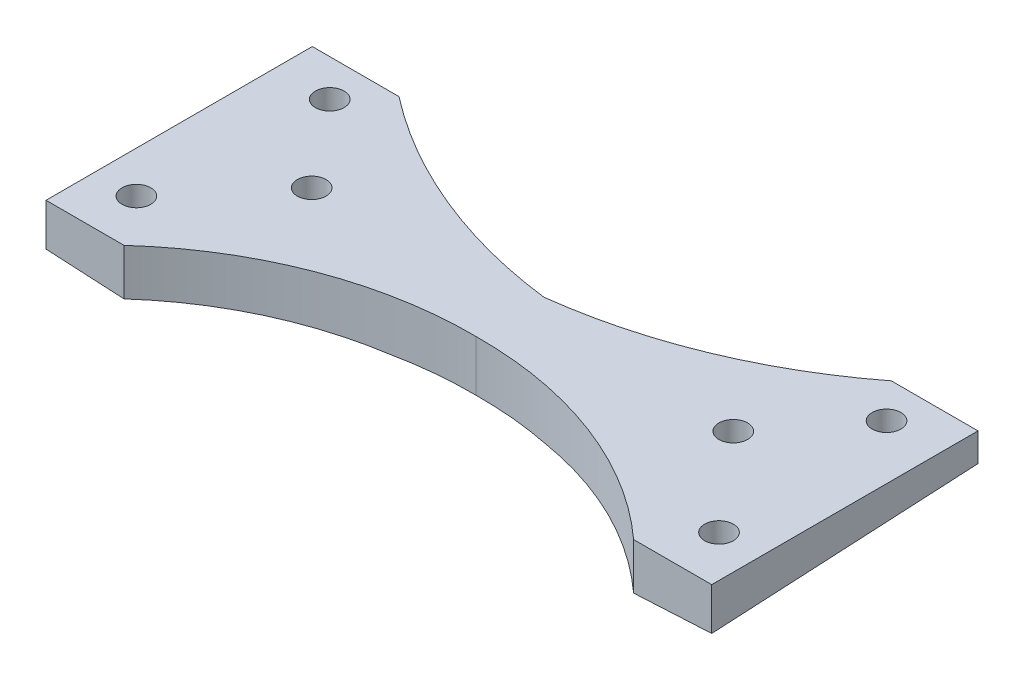
ISO-10303-21;
HEADER;
FILE_DESCRIPTION(('STEP AP214'),'2;1');
FILE_NAME('part.step','',(''),(''),'','','');
FILE_SCHEMA(('AUTOMOTIVE_DESIGN { 1 0 10303 214 1 1 1 1 }'));
ENDSEC;
DATA;
#1=APPLICATION_CONTEXT('core data for automotive mechanical design processes');
#2=APPLICATION_PROTOCOL_DEFINITION('international standard','automotive_design',2000,#1);
#3=PRODUCT_CONTEXT('',#1,'mechanical');
#4=PRODUCT('Part','Part','',(#3));
#5=PRODUCT_RELATED_PRODUCT_CATEGORY('part','',(#4));
#6=PRODUCT_DEFINITION_FORMATION('','',#4);
#7=PRODUCT_DEFINITION_CONTEXT('part definition',#1,'design');
#8=PRODUCT_DEFINITION('design','',#6,#7);
#9=PRODUCT_DEFINITION_SHAPE('','',#8);
#10=(LENGTH_UNIT() NAMED_UNIT(*) SI_UNIT(.MILLI.,.METRE.));
#11=(NAMED_UNIT(*) PLANE_ANGLE_UNIT() SI_UNIT($,.RADIAN.));
#12=(NAMED_UNIT(*) SI_UNIT($,.STERADIAN.) SOLID_ANGLE_UNIT());
#13=UNCERTAINTY_MEASURE_WITH_UNIT(LENGTH_MEASURE(1.E-05),#10,'distance_accuracy_value','');
#14=(GEOMETRIC_REPRESENTATION_CONTEXT(3) GLOBAL_UNCERTAINTY_ASSIGNED_CONTEXT((#13)) GLOBAL_UNIT_ASSIGNED_CONTEXT((#10,
#11,#12)) REPRESENTATION_CONTEXT('',''));
#15=CARTESIAN_POINT('',(0.,0.,0.));
#16=DIRECTION('',(0.,0.,1.));
#17=DIRECTION('',(1.,0.,0.));
#18=AXIS2_PLACEMENT_3D('',#15,#16,#17);
#19=CARTESIAN_POINT('',(0.,43.8649334271713,-12.7));
#20=DIRECTION('',(0.,1.,0.));
#21=DIRECTION('',(-1.,0.,0.));
#22=AXIS2_PLACEMENT_3D('',#19,#20,#21);
#23=PLANE('',#22);
#24=CARTESIAN_POINT('',(-0.330657519158692,43.8649334271713,39.0967859037488));
#25=DIRECTION('',(0.,1.,0.));
#26=DIRECTION('',(-1.,0.,0.));
#27=AXIS2_PLACEMENT_3D('',#24,#25,#26);
#28=CIRCLE('',#27,35.656708656681);
#29=CARTESIAN_POINT('',(0.,43.8649334271713,3.44161043324442));
#30=VERTEX_POINT('',#29);
#31=CARTESIAN_POINT('',(-7.49527492738726,43.8649334271713,4.16729793697291));
#32=VERTEX_POINT('',#31);
#33=EDGE_CURVE('E212',#30,#32,#28,.T.);
#34=ORIENTED_EDGE('',*,*,#33,.T.);
#35=DIRECTION('',(0.707591479715552,0.,-0.706621750184606));
#36=VECTOR('',#35,1.);
#37=CARTESIAN_POINT('',(4.69114310024992,43.8649334271713,-8.00241902829053));
#38=LINE('',#37,#36);
#39=CARTESIAN_POINT('',(-0.245723812969967,43.8649334271713,-3.07231791959667));
#40=VERTEX_POINT('',#39);
#41=EDGE_CURVE('E190',#32,#40,#38,.T.);
#42=ORIENTED_EDGE('',*,*,#41,.T.);
#43=CARTESIAN_POINT('',(5.82833310932793,43.8649334271713,-50.5915810702663));
#44=DIRECTION('',(0.,1.,0.));
#45=DIRECTION('',(-1.,0.,0.));
#46=AXIS2_PLACEMENT_3D('',#43,#44,#45);
#47=CIRCLE('',#46,47.9058925172875);
#48=CARTESIAN_POINT('',(0.,43.8649334271713,-3.04155403510453));
#49=VERTEX_POINT('',#48);
#50=EDGE_CURVE('E146',#40,#49,#47,.T.);
#51=ORIENTED_EDGE('',*,*,#50,.T.);
#52=CARTESIAN_POINT('',(-5.82833310932795,43.8649334271713,-50.5915810702663));
#53=DIRECTION('',(0.,-1.,0.));
#54=DIRECTION('',(1.,0.,0.));
#55=AXIS2_PLACEMENT_3D('',#52,#53,#54);
#56=CIRCLE('',#55,47.9058925172875);
#57=CARTESIAN_POINT('',(0.245723812969947,43.8649334271713,-3.07231791959667));
#58=VERTEX_POINT('',#57);
#59=EDGE_CURVE('E126',#58,#49,#56,.T.);
#60=ORIENTED_EDGE('',*,*,#59,.F.);
#61=DIRECTION('',(-0.707591479715552,0.,-0.706621750184606));
#62=VECTOR('',#61,1.);
#63=CARTESIAN_POINT('',(-4.69114310024994,43.8649334271713,-8.00241902829053));
#64=LINE('',#63,#62);
#65=CARTESIAN_POINT('',(7.49527492738723,43.8649334271713,4.16729793697291));
#66=VERTEX_POINT('',#65);
#67=EDGE_CURVE('E134',#66,#58,#64,.T.);
#68=ORIENTED_EDGE('',*,*,#67,.F.);
#69=CARTESIAN_POINT('',(0.330657519158671,43.8649334271713,39.0967859037488));
#70=DIRECTION('',(0.,-1.,0.));
#71=DIRECTION('',(1.,0.,0.));
#72=AXIS2_PLACEMENT_3D('',#69,#70,#71);
#73=CIRCLE('',#72,35.656708656681);
#74=EDGE_CURVE('E160',#30,#66,#73,.T.);
#75=ORIENTED_EDGE('',*,*,#74,.F.);
#76=EDGE_LOOP('',(#34,#42,#51,#60,#68,#75));
#77=FACE_BOUND('',#76,.T.);
#78=ADVANCED_FACE('F34',(#77),#23,.F.);
#79=CARTESIAN_POINT('',(-31.75,48.7240290397441,-12.7));
#80=DIRECTION('',(-1.,0.,0.));
#81=DIRECTION('',(0.,0.,1.));
#82=AXIS2_PLACEMENT_3D('',#79,#80,#81);
#83=PLANE('',#82);
#84=DIRECTION('',(0.,0.0524075821519379,-0.998625778424024));
#85=VECTOR('',#84,1.);
#86=CARTESIAN_POINT('',(-31.75,46.0286837575568,-12.8414509142023));
#87=LINE('',#86,#85);
#88=CARTESIAN_POINT('',(-31.75,44.6882760533032,12.7));
#89=VERTEX_POINT('',#88);
#90=CARTESIAN_POINT('',(-31.75,46.0212604558889,-12.7));
#91=VERTEX_POINT('',#90);
#92=EDGE_CURVE('E188',#89,#91,#87,.T.);
#93=ORIENTED_EDGE('',*,*,#92,.F.);
#94=DIRECTION('',(0.,-1.,0.));
#95=VECTOR('',#94,1.);
#96=CARTESIAN_POINT('',(-31.75,48.7240290397441,12.7));
#97=LINE('',#96,#95);
#98=CARTESIAN_POINT('',(-31.75,48.7240290397441,12.7));
#99=VERTEX_POINT('',#98);
#100=EDGE_CURVE('E223',#99,#89,#97,.T.);
#101=ORIENTED_EDGE('',*,*,#100,.F.);
#102=DIRECTION('',(0.,0.,1.));
#103=VECTOR('',#102,1.);
#104=CARTESIAN_POINT('',(-31.75,48.7240290397441,-12.7));
#105=LINE('',#104,#103);
#106=CARTESIAN_POINT('',(-31.75,48.7240290397441,-12.7));
#107=VERTEX_POINT('',#106);
#108=EDGE_CURVE('E233',#107,#99,#105,.T.);
#109=ORIENTED_EDGE('',*,*,#108,.F.);
#110=DIRECTION('',(0.,-1.,0.));
#111=VECTOR('',#110,1.);
#112=CARTESIAN_POINT('',(-31.75,48.7240290397441,-12.7));
#113=LINE('',#112,#111);
#114=EDGE_CURVE('E228',#107,#91,#113,.T.);
#115=ORIENTED_EDGE('',*,*,#114,.T.);
#116=EDGE_LOOP('',(#93,#101,#109,#115));
#117=FACE_BOUND('',#116,.T.);
#118=ADVANCED_FACE('F251',(#117),#83,.T.);
#119=CARTESIAN_POINT('',(0.,48.7240290397441,-12.7));
#120=DIRECTION('',(0.,1.,0.));
#121=DIRECTION('',(-1.,0.,0.));
#122=AXIS2_PLACEMENT_3D('',#119,#120,#121);
#123=PLANE('',#122);
#124=CARTESIAN_POINT('',(5.82833310932792,48.7240290397441,-50.5915810702663));
#125=DIRECTION('',(0.,1.,0.));
#126=DIRECTION('',(1.,0.,0.));
#127=AXIS2_PLACEMENT_3D('',#124,#125,#126);
#128=CIRCLE('',#127,47.9058925172875);
#129=CARTESIAN_POINT('',(-23.4838251509118,48.7240290397441,-12.7));
#130=VERTEX_POINT('',#129);
#131=CARTESIAN_POINT('',(0.,48.7240290397441,-3.04155403510453));
#132=VERTEX_POINT('',#131);
#133=EDGE_CURVE('E206',#130,#132,#128,.T.);
#134=ORIENTED_EDGE('',*,*,#133,.F.);
#135=DIRECTION('',(-1.,0.,0.));
#136=VECTOR('',#135,1.);
#137=CARTESIAN_POINT('',(0.,48.7240290397441,-12.7));
#138=LINE('',#137,#136);
#139=EDGE_CURVE('E231',#130,#107,#138,.T.);
#140=ORIENTED_EDGE('',*,*,#139,.T.);
#141=ORIENTED_EDGE('',*,*,#108,.T.);
#142=DIRECTION('',(-1.,0.,0.));
#143=VECTOR('',#142,1.);
#144=CARTESIAN_POINT('',(0.,48.7240290397441,12.7));
#145=LINE('',#144,#143);
#146=CARTESIAN_POINT('',(-24.3016935038441,48.7240290397441,12.7));
#147=VERTEX_POINT('',#146);
#148=EDGE_CURVE('E226',#147,#99,#145,.T.);
#149=ORIENTED_EDGE('',*,*,#148,.F.);
#150=CARTESIAN_POINT('',(-0.330657519158696,48.7240290397441,39.0967859037488));
#151=DIRECTION('',(0.,1.,0.));
#152=DIRECTION('',(-1.,0.,0.));
#153=AXIS2_PLACEMENT_3D('',#150,#151,#152);
#154=CIRCLE('',#153,35.656708656681);
#155=CARTESIAN_POINT('',(0.,48.7240290397441,3.44161043324442));
#156=VERTEX_POINT('',#155);
#157=EDGE_CURVE('E210',#156,#147,#154,.T.);
#158=ORIENTED_EDGE('',*,*,#157,.F.);
#159=CARTESIAN_POINT('',(0.330657519158673,48.7240290397441,39.0967859037488));
#160=DIRECTION('',(0.,-1.,0.));
#161=DIRECTION('',(1.,0.,0.));
#162=AXIS2_PLACEMENT_3D('',#159,#160,#161);
#163=CIRCLE('',#162,35.656708656681);
#164=CARTESIAN_POINT('',(24.3016935038441,48.7240290397441,12.7));
#165=VERTEX_POINT('',#164);
#166=EDGE_CURVE('E148',#156,#165,#163,.T.);
#167=ORIENTED_EDGE('',*,*,#166,.T.);
#168=DIRECTION('',(1.,0.,0.));
#169=VECTOR('',#168,1.);
#170=CARTESIAN_POINT('',(0.,48.7240290397441,12.7));
#171=LINE('',#170,#169);
#172=CARTESIAN_POINT('',(31.75,48.7240290397441,12.7));
#173=VERTEX_POINT('',#172);
#174=EDGE_CURVE('E174',#165,#173,#171,.T.);
#175=ORIENTED_EDGE('',*,*,#174,.T.);
#176=DIRECTION('',(0.,0.,1.));
#177=VECTOR('',#176,1.);
#178=CARTESIAN_POINT('',(31.75,48.7240290397441,-12.7));
#179=LINE('',#178,#177);
#180=CARTESIAN_POINT('',(31.75,48.7240290397441,-12.7));
#181=VERTEX_POINT('',#180);
#182=EDGE_CURVE('E181',#181,#173,#179,.T.);
#183=ORIENTED_EDGE('',*,*,#182,.F.);
#184=DIRECTION('',(1.,0.,0.));
#185=VECTOR('',#184,1.);
#186=CARTESIAN_POINT('',(0.,48.7240290397441,-12.7));
#187=LINE('',#186,#185);
#188=CARTESIAN_POINT('',(23.4838251509118,48.7240290397441,-12.7));
#189=VERTEX_POINT('',#188);
#190=EDGE_CURVE('E179',#189,#181,#187,.T.);
#191=ORIENTED_EDGE('',*,*,#190,.F.);
#192=CARTESIAN_POINT('',(-5.82833310932794,48.7240290397441,-50.5915810702663));
#193=DIRECTION('',(0.,-1.,0.));
#194=DIRECTION('',(-1.,0.,0.));
#195=AXIS2_PLACEMENT_3D('',#192,#193,#194);
#196=CIRCLE('',#195,47.9058925172875);
#197=EDGE_CURVE('E154',#189,#132,#196,.T.);
#198=ORIENTED_EDGE('',*,*,#197,.T.);
#199=EDGE_LOOP('',(#134,#140,#141,#149,#158,#167,#175,#183,#191,#198));
#200=FACE_BOUND('',#199,.T.);
#201=CARTESIAN_POINT('',(-27.7864763711904,48.7240290397441,8.04056841193557));
#202=DIRECTION('',(0.,1.,0.));
#203=DIRECTION('',(-1.,0.,0.));
#204=AXIS2_PLACEMENT_3D('',#201,#202,#203);
#205=CIRCLE('',#204,1.3716);
#206=CARTESIAN_POINT('',(-29.1580763711904,48.7240290397441,8.04056841193557));
#207=VERTEX_POINT('',#206);
#208=EDGE_CURVE('E214',#207,#207,#205,.T.);
#209=ORIENTED_EDGE('',*,*,#208,.F.);
#210=EDGE_LOOP('',(#209));
#211=FACE_BOUND('',#210,.T.);
#212=CARTESIAN_POINT('',(-26.555704526281,48.7240290397441,-9.16997169185407));
#213=DIRECTION('',(0.,1.,0.));
#214=DIRECTION('',(-1.,0.,0.));
#215=AXIS2_PLACEMENT_3D('',#212,#213,#214);
#216=CIRCLE('',#215,1.3716);
#217=CARTESIAN_POINT('',(-27.927304526281,48.7240290397441,-9.16997169185407));
#218=VERTEX_POINT('',#217);
#219=EDGE_CURVE('E217',#218,#218,#216,.T.);
#220=ORIENTED_EDGE('',*,*,#219,.F.);
#221=EDGE_LOOP('',(#220));
#222=FACE_BOUND('',#221,.T.);
#223=CARTESIAN_POINT('',(-20.1056477234083,48.7240290397441,-0.999384842334194));
#224=DIRECTION('',(0.,1.,0.));
#225=DIRECTION('',(-1.,0.,0.));
#226=AXIS2_PLACEMENT_3D('',#223,#224,#225);
#227=CIRCLE('',#226,1.3716);
#228=CARTESIAN_POINT('',(-21.4772477234083,48.7240290397441,-0.999384842334194));
#229=VERTEX_POINT('',#228);
#230=EDGE_CURVE('E220',#229,#229,#227,.T.);
#231=ORIENTED_EDGE('',*,*,#230,.F.);
#232=EDGE_LOOP('',(#231));
#233=FACE_BOUND('',#232,.T.);
#234=CARTESIAN_POINT('',(27.7864763711904,48.7240290397441,8.04056841193557));
#235=DIRECTION('',(0.,-1.,0.));
#236=DIRECTION('',(1.,0.,0.));
#237=AXIS2_PLACEMENT_3D('',#234,#235,#236);
#238=CIRCLE('',#237,1.3716);
#239=CARTESIAN_POINT('',(29.1580763711904,48.7240290397441,8.04056841193557));
#240=VERTEX_POINT('',#239);
#241=EDGE_CURVE('E162',#240,#240,#238,.T.);
#242=ORIENTED_EDGE('',*,*,#241,.T.);
#243=EDGE_LOOP('',(#242));
#244=FACE_BOUND('',#243,.T.);
#245=CARTESIAN_POINT('',(26.555704526281,48.7240290397441,-9.16997169185407));
#246=DIRECTION('',(0.,-1.,0.));
#247=DIRECTION('',(1.,0.,0.));
#248=AXIS2_PLACEMENT_3D('',#245,#246,#247);
#249=CIRCLE('',#248,1.3716);
#250=CARTESIAN_POINT('',(27.927304526281,48.7240290397441,-9.16997169185407));
#251=VERTEX_POINT('',#250);
#252=EDGE_CURVE('E165',#251,#251,#249,.T.);
#253=ORIENTED_EDGE('',*,*,#252,.T.);
#254=EDGE_LOOP('',(#253));
#255=FACE_BOUND('',#254,.T.);
#256=CARTESIAN_POINT('',(20.1056477234083,48.7240290397441,-0.999384842334194));
#257=DIRECTION('',(0.,-1.,0.));
#258=DIRECTION('',(1.,0.,0.));
#259=AXIS2_PLACEMENT_3D('',#256,#257,#258);
#260=CIRCLE('',#259,1.3716);
#261=CARTESIAN_POINT('',(21.4772477234083,48.7240290397441,-0.999384842334194));
#262=VERTEX_POINT('',#261);
#263=EDGE_CURVE('E168',#262,#262,#260,.T.);
#264=ORIENTED_EDGE('',*,*,#263,.T.);
#265=EDGE_LOOP('',(#264));
#266=FACE_BOUND('',#265,.T.);
#267=ADVANCED_FACE('F243',(#200,#211,#222,#233,#244,#255,#266),#123,.T.);
#268=CARTESIAN_POINT('',(0.,0.,-12.7));
#269=DIRECTION('',(0.,0.,-1.));
#270=DIRECTION('',(-1.,0.,0.));
#271=AXIS2_PLACEMENT_3D('',#268,#269,#270);
#272=PLANE('',#271);
#273=DIRECTION('',(0.998629534754574,-0.0523359562429411,0.));
#274=VECTOR('',#273,1.);
#275=CARTESIAN_POINT('',(2.31830090551847,44.2358164614844,-12.7));
#276=LINE('',#275,#274);
#277=CARTESIAN_POINT('',(-23.4838251509118,45.5880485888829,-12.7));
#278=VERTEX_POINT('',#277);
#279=EDGE_CURVE('E48',#91,#278,#276,.T.);
#280=ORIENTED_EDGE('',*,*,#279,.F.);
#281=ORIENTED_EDGE('',*,*,#114,.F.);
#282=ORIENTED_EDGE('',*,*,#139,.F.);
#283=DIRECTION('',(0.,1.,0.));
#284=VECTOR('',#283,1.);
#285=CARTESIAN_POINT('',(-23.4838251509118,38.5640290397441,-12.7));
#286=LINE('',#285,#284);
#287=EDGE_CURVE('E41',#278,#130,#286,.T.);
#288=ORIENTED_EDGE('',*,*,#287,.F.);
#289=EDGE_LOOP('',(#280,#281,#282,#288));
#290=FACE_BOUND('',#289,.T.);
#291=ADVANCED_FACE('F248',(#290),#272,.T.);
#292=CARTESIAN_POINT('',(0.,0.,12.7));
#293=DIRECTION('',(0.,0.,-1.));
#294=DIRECTION('',(-1.,0.,0.));
#295=AXIS2_PLACEMENT_3D('',#292,#293,#294);
#296=PLANE('',#295);
#297=ORIENTED_EDGE('',*,*,#100,.T.);
#298=DIRECTION('',(0.998629534754574,-0.0523359562429411,0.));
#299=VECTOR('',#298,1.);
#300=CARTESIAN_POINT('',(2.24863349993746,42.9064831729136,12.7));
#301=LINE('',#300,#299);
#302=CARTESIAN_POINT('',(-24.3016935038441,44.2979268504203,12.7));
#303=VERTEX_POINT('',#302);
#304=EDGE_CURVE('E195',#89,#303,#301,.T.);
#305=ORIENTED_EDGE('',*,*,#304,.T.);
#306=DIRECTION('',(0.,1.,0.));
#307=VECTOR('',#306,1.);
#308=CARTESIAN_POINT('',(-24.3016935038441,38.5640290397441,12.7));
#309=LINE('',#308,#307);
#310=EDGE_CURVE('E55',#303,#147,#309,.T.);
#311=ORIENTED_EDGE('',*,*,#310,.T.);
#312=ORIENTED_EDGE('',*,*,#148,.T.);
#313=EDGE_LOOP('',(#297,#305,#311,#312));
#314=FACE_BOUND('',#313,.T.);
#315=ADVANCED_FACE('F255',(#314),#296,.F.);
#316=CARTESIAN_POINT('',(-20.1056477234083,38.5640290397441,-0.999384842334194));
#317=DIRECTION('',(0.,1.,0.));
#318=DIRECTION('',(-1.,0.,0.));
#319=AXIS2_PLACEMENT_3D('',#316,#317,#318);
#320=CYLINDRICAL_SURFACE('',#319,1.3716);
#321=CARTESIAN_POINT('',(-20.1056477234083,44.7969610281894,-0.999384842334194));
#322=DIRECTION('',(0.052264231633824,0.997260947684137,0.0523359562429442));
#323=DIRECTION('',(-0.704686276243326,0.0739635195494196,-0.705653349634349));
#324=AXIS2_PLACEMENT_3D('',#321,#322,#323);
#325=ELLIPSE('',#324,1.37536720272178,1.3716);
#326=CARTESIAN_POINT('',(-21.0748501159615,44.8986880271756,-1.96991731591204));
#327=VERTEX_POINT('',#326);
#328=EDGE_CURVE('E203',#327,#327,#325,.F.);
#329=ORIENTED_EDGE('',*,*,#328,.T.);
#330=EDGE_LOOP('',(#329));
#331=FACE_BOUND('',#330,.T.);
#332=ORIENTED_EDGE('',*,*,#230,.T.);
#333=EDGE_LOOP('',(#332));
#334=FACE_BOUND('',#333,.T.);
#335=ADVANCED_FACE('F330',(#331,#334),#320,.F.);
#336=CARTESIAN_POINT('',(-26.555704526281,38.5640290397441,-9.16997169185407));
#337=DIRECTION('',(0.,1.,0.));
#338=DIRECTION('',(-1.,0.,0.));
#339=AXIS2_PLACEMENT_3D('',#336,#337,#338);
#340=CYLINDRICAL_SURFACE('',#339,1.3716);
#341=CARTESIAN_POINT('',(-26.555704526281,45.5637841354295,-9.16997169185407));
#342=DIRECTION('',(0.052264231633824,0.997260947684137,0.0523359562429442));
#343=DIRECTION('',(-0.704686276243326,0.0739635195494196,-0.705653349634349));
#344=AXIS2_PLACEMENT_3D('',#341,#342,#343);
#345=ELLIPSE('',#344,1.37536720272178,1.3716);
#346=CARTESIAN_POINT('',(-27.5249069188342,45.6655111344156,-10.1405041654319));
#347=VERTEX_POINT('',#346);
#348=EDGE_CURVE('E200',#347,#347,#345,.F.);
#349=ORIENTED_EDGE('',*,*,#348,.T.);
#350=EDGE_LOOP('',(#349));
#351=FACE_BOUND('',#350,.T.);
#352=ORIENTED_EDGE('',*,*,#219,.T.);
#353=EDGE_LOOP('',(#352));
#354=FACE_BOUND('',#353,.T.);
#355=ADVANCED_FACE('F333',(#351,#354),#340,.F.);
#356=CARTESIAN_POINT('',(-27.7864763711904,38.5640290397441,8.04056841193557));
#357=DIRECTION('',(0.,1.,0.));
#358=DIRECTION('',(-1.,0.,0.));
#359=AXIS2_PLACEMENT_3D('',#356,#357,#358);
#360=CYLINDRICAL_SURFACE('',#359,1.3716);
#361=CARTESIAN_POINT('',(-27.7864763711904,44.7250821578368,8.04056841193557));
#362=DIRECTION('',(0.052264231633824,0.997260947684137,0.0523359562429442));
#363=DIRECTION('',(-0.704686276243326,0.0739635195494196,-0.705653349634349));
#364=AXIS2_PLACEMENT_3D('',#361,#362,#363);
#365=ELLIPSE('',#364,1.37536720272178,1.3716);
#366=CARTESIAN_POINT('',(-28.7556787637436,44.8268091568229,7.07003593835772));
#367=VERTEX_POINT('',#366);
#368=EDGE_CURVE('E197',#367,#367,#365,.F.);
#369=ORIENTED_EDGE('',*,*,#368,.T.);
#370=EDGE_LOOP('',(#369));
#371=FACE_BOUND('',#370,.T.);
#372=ORIENTED_EDGE('',*,*,#208,.T.);
#373=EDGE_LOOP('',(#372));
#374=FACE_BOUND('',#373,.T.);
#375=ADVANCED_FACE('F337',(#371,#374),#360,.F.);
#376=CARTESIAN_POINT('',(-0.330657519158687,38.5640290397441,39.0967859037488));
#377=DIRECTION('',(0.,1.,0.));
#378=DIRECTION('',(-1.,0.,0.));
#379=AXIS2_PLACEMENT_3D('',#376,#377,#378);
#380=CYLINDRICAL_SURFACE('',#379,35.656708656681);
#381=ORIENTED_EDGE('',*,*,#310,.F.);
#382=CARTESIAN_POINT('',(-0.33065751915869,41.6563626586841,39.0967859037488));
#383=DIRECTION('',(0.052264231633824,0.997260947684137,0.0523359562429442));
#384=DIRECTION('',(-0.704686276243326,0.0739635195494196,-0.705653349634349));
#385=AXIS2_PLACEMENT_3D('',#382,#383,#384);
#386=ELLIPSE('',#385,35.7546424930043,35.656708656681);
#387=EDGE_CURVE('E192',#303,#32,#386,.F.);
#388=ORIENTED_EDGE('',*,*,#387,.T.);
#389=ORIENTED_EDGE('',*,*,#33,.F.);
#390=DIRECTION('',(0.,1.,0.));
#391=VECTOR('',#390,1.);
#392=CARTESIAN_POINT('',(0.,38.5640290397441,3.44161043324442));
#393=LINE('',#392,#391);
#394=EDGE_CURVE('E152',#30,#156,#393,.T.);
#395=ORIENTED_EDGE('',*,*,#394,.T.);
#396=ORIENTED_EDGE('',*,*,#157,.T.);
#397=EDGE_LOOP('',(#381,#388,#389,#395,#396));
#398=FACE_BOUND('',#397,.T.);
#399=ADVANCED_FACE('F257',(#398),#380,.F.);
#400=CARTESIAN_POINT('',(5.82833310932793,38.5640290397441,-50.5915810702663));
#401=DIRECTION('',(0.,1.,0.));
#402=DIRECTION('',(-1.,0.,0.));
#403=AXIS2_PLACEMENT_3D('',#400,#401,#402);
#404=CYLINDRICAL_SURFACE('',#403,47.9058925172875);
#405=ORIENTED_EDGE('',*,*,#50,.F.);
#406=CARTESIAN_POINT('',(5.82833310932792,46.0404023092572,-50.5915810702663));
#407=DIRECTION('',(0.052264231633824,0.997260947684137,0.0523359562429442));
#408=DIRECTION('',(-0.704686276243326,0.0739635195494196,-0.705653349634349));
#409=AXIS2_PLACEMENT_3D('',#406,#407,#408);
#410=ELLIPSE('',#409,48.0374696598074,47.9058925172875);
#411=EDGE_CURVE('E12',#40,#278,#410,.F.);
#412=ORIENTED_EDGE('',*,*,#411,.T.);
#413=ORIENTED_EDGE('',*,*,#287,.T.);
#414=ORIENTED_EDGE('',*,*,#133,.T.);
#415=DIRECTION('',(0.,1.,0.));
#416=VECTOR('',#415,1.);
#417=CARTESIAN_POINT('',(0.,38.5640290397441,-3.04155403510453));
#418=LINE('',#417,#416);
#419=EDGE_CURVE('E149',#49,#132,#418,.T.);
#420=ORIENTED_EDGE('',*,*,#419,.F.);
#421=EDGE_LOOP('',(#405,#412,#413,#414,#420));
#422=FACE_BOUND('',#421,.T.);
#423=ADVANCED_FACE('F239',(#422),#404,.F.);
#424=CARTESIAN_POINT('',(2.27721266659813,43.4518061583874,2.28033779028769));
#425=DIRECTION('',(0.052264231633824,0.997260947684137,0.0523359562429442));
#426=DIRECTION('',(0.,-0.0524075821519379,0.998625778424024));
#427=AXIS2_PLACEMENT_3D('',#424,#425,#426);
#428=PLANE('',#427);
#429=ORIENTED_EDGE('',*,*,#304,.F.);
#430=ORIENTED_EDGE('',*,*,#92,.T.);
#431=ORIENTED_EDGE('',*,*,#279,.T.);
#432=ORIENTED_EDGE('',*,*,#411,.F.);
#433=ORIENTED_EDGE('',*,*,#41,.F.);
#434=ORIENTED_EDGE('',*,*,#387,.F.);
#435=EDGE_LOOP('',(#429,#430,#431,#432,#433,#434));
#436=FACE_BOUND('',#435,.T.);
#437=ORIENTED_EDGE('',*,*,#368,.F.);
#438=EDGE_LOOP('',(#437));
#439=FACE_BOUND('',#438,.T.);
#440=ORIENTED_EDGE('',*,*,#348,.F.);
#441=EDGE_LOOP('',(#440));
#442=FACE_BOUND('',#441,.T.);
#443=ORIENTED_EDGE('',*,*,#328,.F.);
#444=EDGE_LOOP('',(#443));
#445=FACE_BOUND('',#444,.T.);
#446=ADVANCED_FACE('F346',(#436,#439,#442,#445),#428,.F.);
#447=CARTESIAN_POINT('',(31.75,48.7240290397441,-12.7));
#448=DIRECTION('',(1.,0.,0.));
#449=DIRECTION('',(0.,0.,1.));
#450=AXIS2_PLACEMENT_3D('',#447,#448,#449);
#451=PLANE('',#450);
#452=DIRECTION('',(0.,0.0524075821519379,-0.998625778424024));
#453=VECTOR('',#452,1.);
#454=CARTESIAN_POINT('',(31.75,46.0286837575568,-12.8414509142023));
#455=LINE('',#454,#453);
#456=CARTESIAN_POINT('',(31.75,44.6882760533032,12.7));
#457=VERTEX_POINT('',#456);
#458=CARTESIAN_POINT('',(31.75,46.0212604558889,-12.7));
#459=VERTEX_POINT('',#458);
#460=EDGE_CURVE('E141',#457,#459,#455,.T.);
#461=ORIENTED_EDGE('',*,*,#460,.T.);
#462=DIRECTION('',(0.,-1.,0.));
#463=VECTOR('',#462,1.);
#464=CARTESIAN_POINT('',(31.75,48.7240290397441,-12.7));
#465=LINE('',#464,#463);
#466=EDGE_CURVE('E176',#181,#459,#465,.T.);
#467=ORIENTED_EDGE('',*,*,#466,.F.);
#468=ORIENTED_EDGE('',*,*,#182,.T.);
#469=DIRECTION('',(0.,-1.,0.));
#470=VECTOR('',#469,1.);
#471=CARTESIAN_POINT('',(31.75,48.7240290397441,12.7));
#472=LINE('',#471,#470);
#473=EDGE_CURVE('E171',#173,#457,#472,.T.);
#474=ORIENTED_EDGE('',*,*,#473,.T.);
#475=EDGE_LOOP('',(#461,#467,#468,#474));
#476=FACE_BOUND('',#475,.T.);
#477=ADVANCED_FACE('F273',(#476),#451,.T.);
#478=CARTESIAN_POINT('',(0.,0.,-12.7));
#479=DIRECTION('',(0.,0.,-1.));
#480=DIRECTION('',(1.,0.,0.));
#481=AXIS2_PLACEMENT_3D('',#478,#479,#480);
#482=PLANE('',#481);
#483=DIRECTION('',(-0.998629534754574,-0.0523359562429415,0.));
#484=VECTOR('',#483,1.);
#485=CARTESIAN_POINT('',(-2.31830090551849,44.2358164614844,-12.7));
#486=LINE('',#485,#484);
#487=CARTESIAN_POINT('',(23.4838251509118,45.5880485888829,-12.7));
#488=VERTEX_POINT('',#487);
#489=EDGE_CURVE('E276',#459,#488,#486,.T.);
#490=ORIENTED_EDGE('',*,*,#489,.T.);
#491=DIRECTION('',(0.,1.,0.));
#492=VECTOR('',#491,1.);
#493=CARTESIAN_POINT('',(23.4838251509118,38.5640290397441,-12.7));
#494=LINE('',#493,#492);
#495=EDGE_CURVE('E129',#488,#189,#494,.T.);
#496=ORIENTED_EDGE('',*,*,#495,.T.);
#497=ORIENTED_EDGE('',*,*,#190,.T.);
#498=ORIENTED_EDGE('',*,*,#466,.T.);
#499=EDGE_LOOP('',(#490,#496,#497,#498));
#500=FACE_BOUND('',#499,.T.);
#501=ADVANCED_FACE('F275',(#500),#482,.T.);
#502=CARTESIAN_POINT('',(0.,0.,12.7));
#503=DIRECTION('',(0.,0.,-1.));
#504=DIRECTION('',(1.,0.,0.));
#505=AXIS2_PLACEMENT_3D('',#502,#503,#504);
#506=PLANE('',#505);
#507=ORIENTED_EDGE('',*,*,#473,.F.);
#508=ORIENTED_EDGE('',*,*,#174,.F.);
#509=DIRECTION('',(0.,1.,0.));
#510=VECTOR('',#509,1.);
#511=CARTESIAN_POINT('',(24.3016935038441,38.5640290397441,12.7));
#512=LINE('',#511,#510);
#513=CARTESIAN_POINT('',(24.3016935038441,44.2979268504203,12.7));
#514=VERTEX_POINT('',#513);
#515=EDGE_CURVE('E184',#514,#165,#512,.T.);
#516=ORIENTED_EDGE('',*,*,#515,.F.);
#517=DIRECTION('',(-0.998629534754574,-0.0523359562429415,0.));
#518=VECTOR('',#517,1.);
#519=CARTESIAN_POINT('',(-2.24863349993748,42.9064831729136,12.7));
#520=LINE('',#519,#518);
#521=EDGE_CURVE('E269',#457,#514,#520,.T.);
#522=ORIENTED_EDGE('',*,*,#521,.F.);
#523=EDGE_LOOP('',(#507,#508,#516,#522));
#524=FACE_BOUND('',#523,.T.);
#525=ADVANCED_FACE('F268',(#524),#506,.F.);
#526=CARTESIAN_POINT('',(20.1056477234083,38.5640290397441,-0.999384842334194));
#527=DIRECTION('',(0.,1.,0.));
#528=DIRECTION('',(1.,0.,0.));
#529=AXIS2_PLACEMENT_3D('',#526,#527,#528);
#530=CYLINDRICAL_SURFACE('',#529,1.3716);
#531=CARTESIAN_POINT('',(20.1056477234083,44.7969610281894,-0.999384842334194));
#532=DIRECTION('',(0.0522642316338244,-0.997260947684137,-0.0523359562429442));
#533=DIRECTION('',(0.704686276243326,0.0739635195494199,-0.705653349634349));
#534=AXIS2_PLACEMENT_3D('',#531,#532,#533);
#535=ELLIPSE('',#534,1.37536720272178,1.3716);
#536=CARTESIAN_POINT('',(21.0748501159615,44.8986880271756,-1.96991731591204));
#537=VERTEX_POINT('',#536);
#538=EDGE_CURVE('E277',#537,#537,#535,.F.);
#539=ORIENTED_EDGE('',*,*,#538,.F.);
#540=EDGE_LOOP('',(#539));
#541=FACE_BOUND('',#540,.T.);
#542=ORIENTED_EDGE('',*,*,#263,.F.);
#543=EDGE_LOOP('',(#542));
#544=FACE_BOUND('',#543,.T.);
#545=ADVANCED_FACE('F307',(#541,#544),#530,.F.);
#546=CARTESIAN_POINT('',(26.555704526281,38.5640290397441,-9.16997169185407));
#547=DIRECTION('',(0.,1.,0.));
#548=DIRECTION('',(1.,0.,0.));
#549=AXIS2_PLACEMENT_3D('',#546,#547,#548);
#550=CYLINDRICAL_SURFACE('',#549,1.3716);
#551=CARTESIAN_POINT('',(26.555704526281,45.5637841354295,-9.16997169185407));
#552=DIRECTION('',(0.0522642316338244,-0.997260947684137,-0.0523359562429442));
#553=DIRECTION('',(0.704686276243326,0.0739635195494199,-0.705653349634349));
#554=AXIS2_PLACEMENT_3D('',#551,#552,#553);
#555=ELLIPSE('',#554,1.37536720272178,1.3716);
#556=CARTESIAN_POINT('',(27.5249069188342,45.6655111344156,-10.1405041654319));
#557=VERTEX_POINT('',#556);
#558=EDGE_CURVE('E279',#557,#557,#555,.F.);
#559=ORIENTED_EDGE('',*,*,#558,.F.);
#560=EDGE_LOOP('',(#559));
#561=FACE_BOUND('',#560,.T.);
#562=ORIENTED_EDGE('',*,*,#252,.F.);
#563=EDGE_LOOP('',(#562));
#564=FACE_BOUND('',#563,.T.);
#565=ADVANCED_FACE('F296',(#561,#564),#550,.F.);
#566=CARTESIAN_POINT('',(27.7864763711904,38.5640290397441,8.04056841193557));
#567=DIRECTION('',(0.,1.,0.));
#568=DIRECTION('',(1.,0.,0.));
#569=AXIS2_PLACEMENT_3D('',#566,#567,#568);
#570=CYLINDRICAL_SURFACE('',#569,1.3716);
#571=CARTESIAN_POINT('',(27.7864763711904,44.7250821578368,8.04056841193557));
#572=DIRECTION('',(0.0522642316338244,-0.997260947684137,-0.0523359562429442));
#573=DIRECTION('',(0.704686276243326,0.0739635195494199,-0.705653349634349));
#574=AXIS2_PLACEMENT_3D('',#571,#572,#573);
#575=ELLIPSE('',#574,1.37536720272178,1.3716);
#576=CARTESIAN_POINT('',(28.7556787637436,44.8268091568229,7.07003593835772));
#577=VERTEX_POINT('',#576);
#578=EDGE_CURVE('E284',#577,#577,#575,.F.);
#579=ORIENTED_EDGE('',*,*,#578,.F.);
#580=EDGE_LOOP('',(#579));
#581=FACE_BOUND('',#580,.T.);
#582=ORIENTED_EDGE('',*,*,#241,.F.);
#583=EDGE_LOOP('',(#582));
#584=FACE_BOUND('',#583,.T.);
#585=ADVANCED_FACE('F293',(#581,#584),#570,.F.);
#586=CARTESIAN_POINT('',(0.330657519158669,38.5640290397441,39.0967859037488));
#587=DIRECTION('',(0.,1.,0.));
#588=DIRECTION('',(1.,0.,0.));
#589=AXIS2_PLACEMENT_3D('',#586,#587,#588);
#590=CYLINDRICAL_SURFACE('',#589,35.656708656681);
#591=ORIENTED_EDGE('',*,*,#515,.T.);
#592=ORIENTED_EDGE('',*,*,#166,.F.);
#593=ORIENTED_EDGE('',*,*,#394,.F.);
#594=ORIENTED_EDGE('',*,*,#74,.T.);
#595=CARTESIAN_POINT('',(0.33065751915867,41.6563626586841,39.0967859037488));
#596=DIRECTION('',(0.0522642316338244,-0.997260947684137,-0.0523359562429442));
#597=DIRECTION('',(0.704686276243326,0.0739635195494199,-0.705653349634349));
#598=AXIS2_PLACEMENT_3D('',#595,#596,#597);
#599=ELLIPSE('',#598,35.7546424930043,35.656708656681);
#600=EDGE_CURVE('E138',#514,#66,#599,.F.);
#601=ORIENTED_EDGE('',*,*,#600,.F.);
#602=EDGE_LOOP('',(#591,#592,#593,#594,#601));
#603=FACE_BOUND('',#602,.T.);
#604=ADVANCED_FACE('F261',(#603),#590,.F.);
#605=CARTESIAN_POINT('',(-5.82833310932795,38.5640290397441,-50.5915810702663));
#606=DIRECTION('',(0.,1.,0.));
#607=DIRECTION('',(1.,0.,0.));
#608=AXIS2_PLACEMENT_3D('',#605,#606,#607);
#609=CYLINDRICAL_SURFACE('',#608,47.9058925172875);
#610=ORIENTED_EDGE('',*,*,#59,.T.);
#611=ORIENTED_EDGE('',*,*,#419,.T.);
#612=ORIENTED_EDGE('',*,*,#197,.F.);
#613=ORIENTED_EDGE('',*,*,#495,.F.);
#614=CARTESIAN_POINT('',(-5.82833310932795,46.0404023092572,-50.5915810702663));
#615=DIRECTION('',(0.0522642316338244,-0.997260947684137,-0.0523359562429442));
#616=DIRECTION('',(0.704686276243326,0.0739635195494199,-0.705653349634349));
#617=AXIS2_PLACEMENT_3D('',#614,#615,#616);
#618=ELLIPSE('',#617,48.0374696598074,47.9058925172875);
#619=EDGE_CURVE('E121',#58,#488,#618,.F.);
#620=ORIENTED_EDGE('',*,*,#619,.F.);
#621=EDGE_LOOP('',(#610,#611,#612,#613,#620));
#622=FACE_BOUND('',#621,.T.);
#623=ADVANCED_FACE('F123',(#622),#609,.F.);
#624=CARTESIAN_POINT('',(-2.27721266659815,43.4518061583874,2.28033779028769));
#625=DIRECTION('',(-0.0522642316338244,0.997260947684137,0.0523359562429442));
#626=DIRECTION('',(0.,-0.0524075821519379,0.998625778424024));
#627=AXIS2_PLACEMENT_3D('',#624,#625,#626);
#628=PLANE('',#627);
#629=ORIENTED_EDGE('',*,*,#521,.T.);
#630=ORIENTED_EDGE('',*,*,#600,.T.);
#631=ORIENTED_EDGE('',*,*,#67,.T.);
#632=ORIENTED_EDGE('',*,*,#619,.T.);
#633=ORIENTED_EDGE('',*,*,#489,.F.);
#634=ORIENTED_EDGE('',*,*,#460,.F.);
#635=EDGE_LOOP('',(#629,#630,#631,#632,#633,#634));
#636=FACE_BOUND('',#635,.T.);
#637=ORIENTED_EDGE('',*,*,#578,.T.);
#638=EDGE_LOOP('',(#637));
#639=FACE_BOUND('',#638,.T.);
#640=ORIENTED_EDGE('',*,*,#558,.T.);
#641=EDGE_LOOP('',(#640));
#642=FACE_BOUND('',#641,.T.);
#643=ORIENTED_EDGE('',*,*,#538,.T.);
#644=EDGE_LOOP('',(#643));
#645=FACE_BOUND('',#644,.T.);
#646=ADVANCED_FACE('F136',(#636,#639,#642,#645),#628,.F.);
#647=CLOSED_SHELL('',(#78,#118,#267,#291,#315,#335,#355,#375,#399,#423,#446,#477,#501,#525,#545,
#565,#585,#604,#623,#646));
#648=MANIFOLD_SOLID_BREP('B2',#647);
#649=ADVANCED_BREP_SHAPE_REPRESENTATION('',(#18,#648),#14);
#650=SHAPE_DEFINITION_REPRESENTATION(#9,#649);
ENDSEC;
END-ISO-10303-21;
